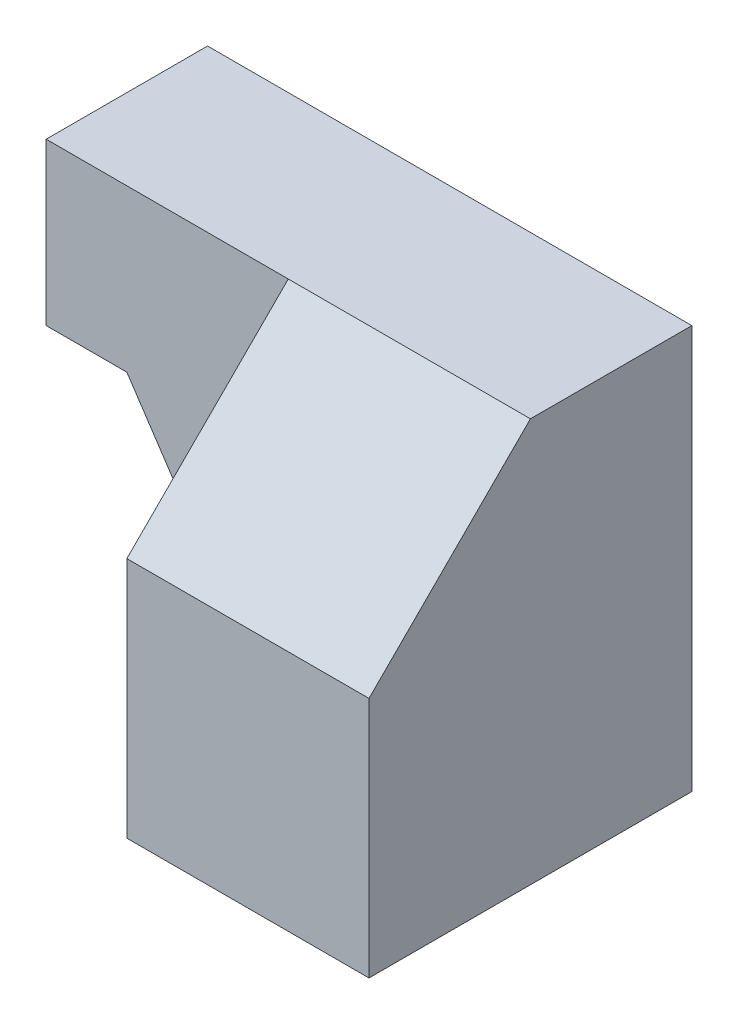
ISO-10303-21;
HEADER;
FILE_DESCRIPTION(('STEP AP214'),'2;1');
FILE_NAME('part.step','',(''),(''),'','','');
FILE_SCHEMA(('AUTOMOTIVE_DESIGN { 1 0 10303 214 1 1 1 1 }'));
ENDSEC;
DATA;
#1=APPLICATION_CONTEXT('core data for automotive mechanical design processes');
#2=APPLICATION_PROTOCOL_DEFINITION('international standard','automotive_design',2000,#1);
#3=PRODUCT_CONTEXT('',#1,'mechanical');
#4=PRODUCT('Part','Part','',(#3));
#5=PRODUCT_RELATED_PRODUCT_CATEGORY('part','',(#4));
#6=PRODUCT_DEFINITION_FORMATION('','',#4);
#7=PRODUCT_DEFINITION_CONTEXT('part definition',#1,'design');
#8=PRODUCT_DEFINITION('design','',#6,#7);
#9=PRODUCT_DEFINITION_SHAPE('','',#8);
#10=(LENGTH_UNIT() NAMED_UNIT(*) SI_UNIT(.MILLI.,.METRE.));
#11=(NAMED_UNIT(*) PLANE_ANGLE_UNIT() SI_UNIT($,.RADIAN.));
#12=(NAMED_UNIT(*) SI_UNIT($,.STERADIAN.) SOLID_ANGLE_UNIT());
#13=UNCERTAINTY_MEASURE_WITH_UNIT(LENGTH_MEASURE(1.E-05),#10,'distance_accuracy_value','');
#14=(GEOMETRIC_REPRESENTATION_CONTEXT(3) GLOBAL_UNCERTAINTY_ASSIGNED_CONTEXT((#13)) GLOBAL_UNIT_ASSIGNED_CONTEXT((#10,
#11,#12)) REPRESENTATION_CONTEXT('',''));
#15=CARTESIAN_POINT('',(0.,0.,0.));
#16=DIRECTION('',(0.,0.,1.));
#17=DIRECTION('',(1.,0.,0.));
#18=AXIS2_PLACEMENT_3D('',#15,#16,#17);
#19=CARTESIAN_POINT('',(-10.,15.,20.));
#20=DIRECTION('',(0.832050294337844,0.554700196225229,0.));
#21=DIRECTION('',(-0.554700196225229,0.832050294337844,0.));
#22=AXIS2_PLACEMENT_3D('',#19,#20,#21);
#23=PLANE('',#22);
#24=DIRECTION('',(0.,0.,-1.));
#25=VECTOR('',#24,1.);
#26=CARTESIAN_POINT('',(0.,0.,20.));
#27=LINE('',#26,#25);
#28=CARTESIAN_POINT('',(0.,0.,10.));
#29=VERTEX_POINT('',#28);
#30=CARTESIAN_POINT('',(0.,0.,0.));
#31=VERTEX_POINT('',#30);
#32=EDGE_CURVE('E41',#29,#31,#27,.T.);
#33=ORIENTED_EDGE('',*,*,#32,.F.);
#34=DIRECTION('',(0.554700196225229,-0.832050294337844,0.));
#35=VECTOR('',#34,1.);
#36=CARTESIAN_POINT('',(-10.,15.,10.));
#37=LINE('',#36,#35);
#38=CARTESIAN_POINT('',(-10.,15.,10.));
#39=VERTEX_POINT('',#38);
#40=EDGE_CURVE('E85',#39,#29,#37,.T.);
#41=ORIENTED_EDGE('',*,*,#40,.F.);
#42=DIRECTION('',(0.,0.,-1.));
#43=VECTOR('',#42,1.);
#44=CARTESIAN_POINT('',(-10.,15.,20.));
#45=LINE('',#44,#43);
#46=CARTESIAN_POINT('',(-10.,15.,0.));
#47=VERTEX_POINT('',#46);
#48=EDGE_CURVE('E80',#39,#47,#45,.T.);
#49=ORIENTED_EDGE('',*,*,#48,.T.);
#50=DIRECTION('',(0.554700196225229,-0.832050294337844,0.));
#51=VECTOR('',#50,1.);
#52=CARTESIAN_POINT('',(-10.,15.,0.));
#53=LINE('',#52,#51);
#54=EDGE_CURVE('E83',#47,#31,#53,.T.);
#55=ORIENTED_EDGE('',*,*,#54,.T.);
#56=EDGE_LOOP('',(#33,#41,#49,#55));
#57=FACE_BOUND('',#56,.T.);
#58=ADVANCED_FACE('F33',(#57),#23,.F.);
#59=CARTESIAN_POINT('',(0.,0.,20.));
#60=DIRECTION('',(0.,1.,0.));
#61=DIRECTION('',(0.,0.,1.));
#62=AXIS2_PLACEMENT_3D('',#59,#60,#61);
#63=PLANE('',#62);
#64=DIRECTION('',(1.,0.,0.));
#65=VECTOR('',#64,1.);
#66=CARTESIAN_POINT('',(0.,0.,0.));
#67=LINE('',#66,#65);
#68=CARTESIAN_POINT('',(15.,0.,0.));
#69=VERTEX_POINT('',#68);
#70=EDGE_CURVE('E98',#31,#69,#67,.T.);
#71=ORIENTED_EDGE('',*,*,#70,.T.);
#72=DIRECTION('',(0.,0.,-1.));
#73=VECTOR('',#72,1.);
#74=CARTESIAN_POINT('',(15.,0.,20.));
#75=LINE('',#74,#73);
#76=CARTESIAN_POINT('',(15.,0.,20.));
#77=VERTEX_POINT('',#76);
#78=EDGE_CURVE('E119',#77,#69,#75,.T.);
#79=ORIENTED_EDGE('',*,*,#78,.F.);
#80=DIRECTION('',(1.,0.,0.));
#81=VECTOR('',#80,1.);
#82=CARTESIAN_POINT('',(0.,0.,20.));
#83=LINE('',#82,#81);
#84=CARTESIAN_POINT('',(0.,0.,20.));
#85=VERTEX_POINT('',#84);
#86=EDGE_CURVE('E49',#85,#77,#83,.T.);
#87=ORIENTED_EDGE('',*,*,#86,.F.);
#88=EDGE_CURVE('E11',#85,#29,#27,.T.);
#89=ORIENTED_EDGE('',*,*,#88,.T.);
#90=ORIENTED_EDGE('',*,*,#32,.T.);
#91=EDGE_LOOP('',(#71,#79,#87,#89,#90));
#92=FACE_BOUND('',#91,.T.);
#93=ADVANCED_FACE('F124',(#92),#63,.F.);
#94=CARTESIAN_POINT('',(15.,0.,20.));
#95=DIRECTION('',(-1.,0.,0.));
#96=DIRECTION('',(0.,0.,1.));
#97=AXIS2_PLACEMENT_3D('',#94,#95,#96);
#98=PLANE('',#97);
#99=DIRECTION('',(0.,0.,-1.));
#100=VECTOR('',#99,1.);
#101=CARTESIAN_POINT('',(15.,25.,20.));
#102=LINE('',#101,#100);
#103=CARTESIAN_POINT('',(15.,25.,10.));
#104=VERTEX_POINT('',#103);
#105=CARTESIAN_POINT('',(15.,25.,0.));
#106=VERTEX_POINT('',#105);
#107=EDGE_CURVE('E118',#104,#106,#102,.T.);
#108=ORIENTED_EDGE('',*,*,#107,.F.);
#109=DIRECTION('',(0.,-0.707106781186548,0.707106781186548));
#110=VECTOR('',#109,1.);
#111=CARTESIAN_POINT('',(15.,7.5,27.5));
#112=LINE('',#111,#110);
#113=CARTESIAN_POINT('',(15.,15.,20.));
#114=VERTEX_POINT('',#113);
#115=EDGE_CURVE('E254',#104,#114,#112,.T.);
#116=ORIENTED_EDGE('',*,*,#115,.T.);
#117=DIRECTION('',(0.,1.,0.));
#118=VECTOR('',#117,1.);
#119=CARTESIAN_POINT('',(15.,0.,20.));
#120=LINE('',#119,#118);
#121=EDGE_CURVE('E86',#77,#114,#120,.T.);
#122=ORIENTED_EDGE('',*,*,#121,.F.);
#123=ORIENTED_EDGE('',*,*,#78,.T.);
#124=DIRECTION('',(0.,1.,0.));
#125=VECTOR('',#124,1.);
#126=CARTESIAN_POINT('',(15.,0.,0.));
#127=LINE('',#126,#125);
#128=EDGE_CURVE('E101',#69,#106,#127,.T.);
#129=ORIENTED_EDGE('',*,*,#128,.T.);
#130=EDGE_LOOP('',(#108,#116,#122,#123,#129));
#131=FACE_BOUND('',#130,.T.);
#132=ADVANCED_FACE('F160',(#131),#98,.F.);
#133=CARTESIAN_POINT('',(15.,25.,20.));
#134=DIRECTION('',(0.,-1.,0.));
#135=DIRECTION('',(1.,0.,0.));
#136=AXIS2_PLACEMENT_3D('',#133,#134,#135);
#137=PLANE('',#136);
#138=DIRECTION('',(-1.,0.,0.));
#139=VECTOR('',#138,1.);
#140=CARTESIAN_POINT('',(0.,25.,10.));
#141=LINE('',#140,#139);
#142=CARTESIAN_POINT('',(0.,25.,10.));
#143=VERTEX_POINT('',#142);
#144=CARTESIAN_POINT('',(-15.,25.,10.));
#145=VERTEX_POINT('',#144);
#146=EDGE_CURVE('E260',#143,#145,#141,.T.);
#147=ORIENTED_EDGE('',*,*,#146,.F.);
#148=DIRECTION('',(-1.,0.,0.));
#149=VECTOR('',#148,1.);
#150=CARTESIAN_POINT('',(20.,25.,10.));
#151=LINE('',#150,#149);
#152=EDGE_CURVE('E158',#104,#143,#151,.T.);
#153=ORIENTED_EDGE('',*,*,#152,.F.);
#154=ORIENTED_EDGE('',*,*,#107,.T.);
#155=DIRECTION('',(-1.,0.,0.));
#156=VECTOR('',#155,1.);
#157=CARTESIAN_POINT('',(15.,25.,0.));
#158=LINE('',#157,#156);
#159=CARTESIAN_POINT('',(-15.,25.,0.));
#160=VERTEX_POINT('',#159);
#161=EDGE_CURVE('E111',#106,#160,#158,.T.);
#162=ORIENTED_EDGE('',*,*,#161,.T.);
#163=DIRECTION('',(0.,0.,-1.));
#164=VECTOR('',#163,1.);
#165=CARTESIAN_POINT('',(-15.,25.,20.));
#166=LINE('',#165,#164);
#167=EDGE_CURVE('E116',#145,#160,#166,.T.);
#168=ORIENTED_EDGE('',*,*,#167,.F.);
#169=EDGE_LOOP('',(#147,#153,#154,#162,#168));
#170=FACE_BOUND('',#169,.T.);
#171=ADVANCED_FACE('F155',(#170),#137,.F.);
#172=CARTESIAN_POINT('',(-15.,25.,20.));
#173=DIRECTION('',(1.,0.,0.));
#174=DIRECTION('',(0.,1.,0.));
#175=AXIS2_PLACEMENT_3D('',#172,#173,#174);
#176=PLANE('',#175);
#177=DIRECTION('',(0.,0.,-1.));
#178=VECTOR('',#177,1.);
#179=CARTESIAN_POINT('',(-15.,15.,20.));
#180=LINE('',#179,#178);
#181=CARTESIAN_POINT('',(-15.,15.,10.));
#182=VERTEX_POINT('',#181);
#183=CARTESIAN_POINT('',(-15.,15.,0.));
#184=VERTEX_POINT('',#183);
#185=EDGE_CURVE('E73',#182,#184,#180,.T.);
#186=ORIENTED_EDGE('',*,*,#185,.F.);
#187=DIRECTION('',(0.,-1.,0.));
#188=VECTOR('',#187,1.);
#189=CARTESIAN_POINT('',(-15.,25.,10.));
#190=LINE('',#189,#188);
#191=EDGE_CURVE('E104',#145,#182,#190,.T.);
#192=ORIENTED_EDGE('',*,*,#191,.F.);
#193=ORIENTED_EDGE('',*,*,#167,.T.);
#194=DIRECTION('',(0.,-1.,0.));
#195=VECTOR('',#194,1.);
#196=CARTESIAN_POINT('',(-15.,25.,0.));
#197=LINE('',#196,#195);
#198=EDGE_CURVE('E93',#160,#184,#197,.T.);
#199=ORIENTED_EDGE('',*,*,#198,.T.);
#200=EDGE_LOOP('',(#186,#192,#193,#199));
#201=FACE_BOUND('',#200,.T.);
#202=ADVANCED_FACE('F150',(#201),#176,.F.);
#203=CARTESIAN_POINT('',(-15.,15.,20.));
#204=DIRECTION('',(0.,1.,0.));
#205=DIRECTION('',(0.,0.,1.));
#206=AXIS2_PLACEMENT_3D('',#203,#204,#205);
#207=PLANE('',#206);
#208=ORIENTED_EDGE('',*,*,#48,.F.);
#209=DIRECTION('',(1.,0.,0.));
#210=VECTOR('',#209,1.);
#211=CARTESIAN_POINT('',(-15.,15.,10.));
#212=LINE('',#211,#210);
#213=EDGE_CURVE('E99',#182,#39,#212,.T.);
#214=ORIENTED_EDGE('',*,*,#213,.F.);
#215=ORIENTED_EDGE('',*,*,#185,.T.);
#216=DIRECTION('',(1.,0.,0.));
#217=VECTOR('',#216,1.);
#218=CARTESIAN_POINT('',(-15.,15.,0.));
#219=LINE('',#218,#217);
#220=EDGE_CURVE('E89',#184,#47,#219,.T.);
#221=ORIENTED_EDGE('',*,*,#220,.T.);
#222=EDGE_LOOP('',(#208,#214,#215,#221));
#223=FACE_BOUND('',#222,.T.);
#224=ADVANCED_FACE('F90',(#223),#207,.F.);
#225=CARTESIAN_POINT('',(0.,0.,20.));
#226=DIRECTION('',(0.,0.,1.));
#227=DIRECTION('',(1.,0.,0.));
#228=AXIS2_PLACEMENT_3D('',#225,#226,#227);
#229=PLANE('',#228);
#230=DIRECTION('',(-1.,0.,0.));
#231=VECTOR('',#230,1.);
#232=CARTESIAN_POINT('',(20.,15.,20.));
#233=LINE('',#232,#231);
#234=CARTESIAN_POINT('',(0.,15.,20.));
#235=VERTEX_POINT('',#234);
#236=EDGE_CURVE('E255',#114,#235,#233,.T.);
#237=ORIENTED_EDGE('',*,*,#236,.T.);
#238=DIRECTION('',(0.,1.,0.));
#239=VECTOR('',#238,1.);
#240=CARTESIAN_POINT('',(0.,0.,20.));
#241=LINE('',#240,#239);
#242=EDGE_CURVE('E258',#85,#235,#241,.T.);
#243=ORIENTED_EDGE('',*,*,#242,.F.);
#244=ORIENTED_EDGE('',*,*,#86,.T.);
#245=ORIENTED_EDGE('',*,*,#121,.T.);
#246=EDGE_LOOP('',(#237,#243,#244,#245));
#247=FACE_BOUND('',#246,.T.);
#248=ADVANCED_FACE('F194',(#247),#229,.T.);
#249=CARTESIAN_POINT('',(0.,0.,0.));
#250=DIRECTION('',(0.,0.,1.));
#251=DIRECTION('',(1.,0.,0.));
#252=AXIS2_PLACEMENT_3D('',#249,#250,#251);
#253=PLANE('',#252);
#254=ORIENTED_EDGE('',*,*,#54,.F.);
#255=ORIENTED_EDGE('',*,*,#220,.F.);
#256=ORIENTED_EDGE('',*,*,#198,.F.);
#257=ORIENTED_EDGE('',*,*,#161,.F.);
#258=ORIENTED_EDGE('',*,*,#128,.F.);
#259=ORIENTED_EDGE('',*,*,#70,.F.);
#260=EDGE_LOOP('',(#254,#255,#256,#257,#258,#259));
#261=FACE_BOUND('',#260,.T.);
#262=ADVANCED_FACE('F96',(#261),#253,.F.);
#263=CARTESIAN_POINT('',(0.,0.,10.));
#264=DIRECTION('',(1.,0.,0.));
#265=DIRECTION('',(0.,0.,-1.));
#266=AXIS2_PLACEMENT_3D('',#263,#264,#265);
#267=PLANE('',#266);
#268=ORIENTED_EDGE('',*,*,#242,.T.);
#269=DIRECTION('',(0.,-0.707106781186548,0.707106781186548));
#270=VECTOR('',#269,1.);
#271=CARTESIAN_POINT('',(0.,25.,10.));
#272=LINE('',#271,#270);
#273=EDGE_CURVE('E252',#143,#235,#272,.T.);
#274=ORIENTED_EDGE('',*,*,#273,.F.);
#275=DIRECTION('',(0.,1.,0.));
#276=VECTOR('',#275,1.);
#277=CARTESIAN_POINT('',(0.,0.,10.));
#278=LINE('',#277,#276);
#279=EDGE_CURVE('E133',#29,#143,#278,.T.);
#280=ORIENTED_EDGE('',*,*,#279,.F.);
#281=ORIENTED_EDGE('',*,*,#88,.F.);
#282=EDGE_LOOP('',(#268,#274,#280,#281));
#283=FACE_BOUND('',#282,.T.);
#284=ADVANCED_FACE('F218',(#283),#267,.F.);
#285=CARTESIAN_POINT('',(0.,0.,10.));
#286=DIRECTION('',(0.,0.,-1.));
#287=DIRECTION('',(-1.,0.,0.));
#288=AXIS2_PLACEMENT_3D('',#285,#286,#287);
#289=PLANE('',#288);
#290=ORIENTED_EDGE('',*,*,#40,.T.);
#291=ORIENTED_EDGE('',*,*,#279,.T.);
#292=ORIENTED_EDGE('',*,*,#146,.T.);
#293=ORIENTED_EDGE('',*,*,#191,.T.);
#294=ORIENTED_EDGE('',*,*,#213,.T.);
#295=EDGE_LOOP('',(#290,#291,#292,#293,#294));
#296=FACE_BOUND('',#295,.T.);
#297=ADVANCED_FACE('F147',(#296),#289,.F.);
#298=CARTESIAN_POINT('',(20.,25.,10.));
#299=DIRECTION('',(0.,-0.707106781186548,-0.707106781186548));
#300=DIRECTION('',(0.,0.707106781186548,-0.707106781186548));
#301=AXIS2_PLACEMENT_3D('',#298,#299,#300);
#302=PLANE('',#301);
#303=ORIENTED_EDGE('',*,*,#152,.T.);
#304=ORIENTED_EDGE('',*,*,#273,.T.);
#305=ORIENTED_EDGE('',*,*,#236,.F.);
#306=ORIENTED_EDGE('',*,*,#115,.F.);
#307=EDGE_LOOP('',(#303,#304,#305,#306));
#308=FACE_BOUND('',#307,.T.);
#309=ADVANCED_FACE('F231',(#308),#302,.F.);
#310=CLOSED_SHELL('',(#58,#93,#132,#171,#202,#224,#248,#262,#284,#297,#309));
#311=MANIFOLD_SOLID_BREP('B2',#310);
#312=ADVANCED_BREP_SHAPE_REPRESENTATION('',(#18,#311),#14);
#313=SHAPE_DEFINITION_REPRESENTATION(#9,#312);
ENDSEC;
END-ISO-10303-21;
